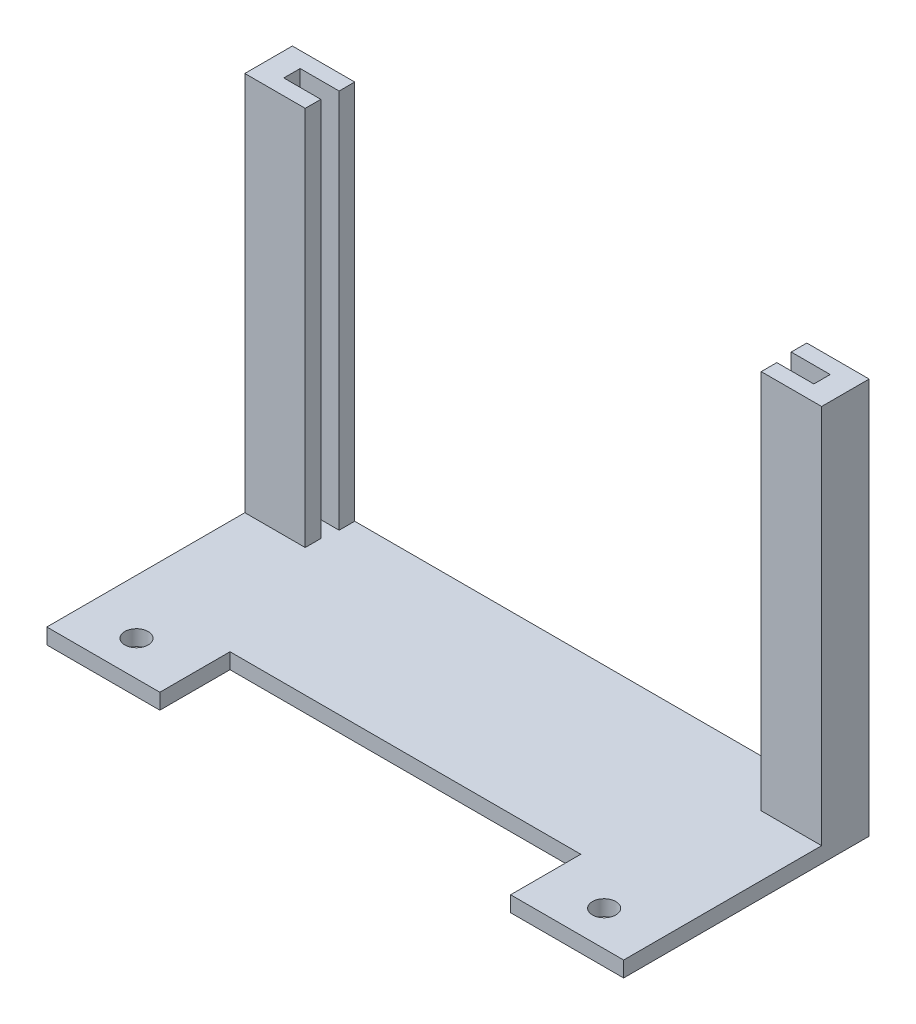
ISO-10303-21;
HEADER;
FILE_DESCRIPTION(('STEP AP214'),'2;1');
FILE_NAME('part.step','',(''),(''),'','','');
FILE_SCHEMA(('AUTOMOTIVE_DESIGN { 1 0 10303 214 1 1 1 1 }'));
ENDSEC;
DATA;
#1=APPLICATION_CONTEXT('core data for automotive mechanical design processes');
#2=APPLICATION_PROTOCOL_DEFINITION('international standard','automotive_design',2000,#1);
#3=PRODUCT_CONTEXT('',#1,'mechanical');
#4=PRODUCT('Part','Part','',(#3));
#5=PRODUCT_RELATED_PRODUCT_CATEGORY('part','',(#4));
#6=PRODUCT_DEFINITION_FORMATION('','',#4);
#7=PRODUCT_DEFINITION_CONTEXT('part definition',#1,'design');
#8=PRODUCT_DEFINITION('design','',#6,#7);
#9=PRODUCT_DEFINITION_SHAPE('','',#8);
#10=(LENGTH_UNIT() NAMED_UNIT(*) SI_UNIT(.MILLI.,.METRE.));
#11=(NAMED_UNIT(*) PLANE_ANGLE_UNIT() SI_UNIT($,.RADIAN.));
#12=(NAMED_UNIT(*) SI_UNIT($,.STERADIAN.) SOLID_ANGLE_UNIT());
#13=UNCERTAINTY_MEASURE_WITH_UNIT(LENGTH_MEASURE(1.E-05),#10,'distance_accuracy_value','');
#14=(GEOMETRIC_REPRESENTATION_CONTEXT(3) GLOBAL_UNCERTAINTY_ASSIGNED_CONTEXT((#13)) GLOBAL_UNIT_ASSIGNED_CONTEXT((#10,
#11,#12)) REPRESENTATION_CONTEXT('',''));
#15=CARTESIAN_POINT('',(0.,0.,0.));
#16=DIRECTION('',(0.,0.,1.));
#17=DIRECTION('',(1.,0.,0.));
#18=AXIS2_PLACEMENT_3D('',#15,#16,#17);
#19=CARTESIAN_POINT('',(0.,2.,0.));
#20=DIRECTION('',(0.,1.,0.));
#21=DIRECTION('',(0.,0.,1.));
#22=AXIS2_PLACEMENT_3D('',#19,#20,#21);
#23=PLANE('',#22);
#24=CARTESIAN_POINT('',(30.,2.,11.25));
#25=DIRECTION('',(0.,1.,0.));
#26=DIRECTION('',(0.,0.,1.));
#27=AXIS2_PLACEMENT_3D('',#24,#25,#26);
#28=CIRCLE('',#27,1.5);
#29=CARTESIAN_POINT('',(30.,2.,12.75));
#30=VERTEX_POINT('',#29);
#31=EDGE_CURVE('E353',#30,#30,#28,.T.);
#32=ORIENTED_EDGE('',*,*,#31,.F.);
#33=EDGE_LOOP('',(#32));
#34=FACE_BOUND('',#33,.T.);
#35=CARTESIAN_POINT('',(-30.,2.,11.25));
#36=DIRECTION('',(0.,1.,0.));
#37=DIRECTION('',(0.,0.,1.));
#38=AXIS2_PLACEMENT_3D('',#35,#36,#37);
#39=CIRCLE('',#38,1.5);
#40=CARTESIAN_POINT('',(-30.,2.,12.75));
#41=VERTEX_POINT('',#40);
#42=EDGE_CURVE('E357',#41,#41,#39,.T.);
#43=ORIENTED_EDGE('',*,*,#42,.F.);
#44=EDGE_LOOP('',(#43));
#45=FACE_BOUND('',#44,.T.);
#46=DIRECTION('',(0.,0.,1.));
#47=VECTOR('',#46,1.);
#48=CARTESIAN_POINT('',(37.,2.,0.));
#49=LINE('',#48,#47);
#50=CARTESIAN_POINT('',(37.,2.,-9.65000000000001));
#51=VERTEX_POINT('',#50);
#52=CARTESIAN_POINT('',(37.,2.,15.75));
#53=VERTEX_POINT('',#52);
#54=EDGE_CURVE('E328',#51,#53,#49,.T.);
#55=ORIENTED_EDGE('',*,*,#54,.F.);
#56=DIRECTION('',(-1.,0.,0.));
#57=VECTOR('',#56,1.);
#58=CARTESIAN_POINT('',(0.,2.,-9.65000000000001));
#59=LINE('',#58,#57);
#60=CARTESIAN_POINT('',(29.25,2.,-9.65000000000001));
#61=VERTEX_POINT('',#60);
#62=EDGE_CURVE('E242',#51,#61,#59,.T.);
#63=ORIENTED_EDGE('',*,*,#62,.T.);
#64=DIRECTION('',(0.,0.,-1.));
#65=VECTOR('',#64,1.);
#66=CARTESIAN_POINT('',(29.25,2.,0.));
#67=LINE('',#66,#65);
#68=CARTESIAN_POINT('',(29.25,2.,-11.65));
#69=VERTEX_POINT('',#68);
#70=EDGE_CURVE('E218',#61,#69,#67,.T.);
#71=ORIENTED_EDGE('',*,*,#70,.T.);
#72=DIRECTION('',(1.,0.,0.));
#73=VECTOR('',#72,1.);
#74=CARTESIAN_POINT('',(0.,2.,-11.65));
#75=LINE('',#74,#73);
#76=CARTESIAN_POINT('',(34.,2.,-11.65));
#77=VERTEX_POINT('',#76);
#78=EDGE_CURVE('E220',#69,#77,#75,.T.);
#79=ORIENTED_EDGE('',*,*,#78,.T.);
#80=DIRECTION('',(0.,0.,-1.));
#81=VECTOR('',#80,1.);
#82=CARTESIAN_POINT('',(34.,2.,0.));
#83=LINE('',#82,#81);
#84=CARTESIAN_POINT('',(34.,2.,-13.75));
#85=VERTEX_POINT('',#84);
#86=EDGE_CURVE('E225',#77,#85,#83,.T.);
#87=ORIENTED_EDGE('',*,*,#86,.T.);
#88=DIRECTION('',(-1.,0.,0.));
#89=VECTOR('',#88,1.);
#90=CARTESIAN_POINT('',(0.,2.,-13.75));
#91=LINE('',#90,#89);
#92=CARTESIAN_POINT('',(29.,2.,-13.75));
#93=VERTEX_POINT('',#92);
#94=EDGE_CURVE('E234',#85,#93,#91,.T.);
#95=ORIENTED_EDGE('',*,*,#94,.T.);
#96=DIRECTION('',(0.,0.,-1.));
#97=VECTOR('',#96,1.);
#98=CARTESIAN_POINT('',(29.,2.,0.));
#99=LINE('',#98,#97);
#100=CARTESIAN_POINT('',(29.,2.,-15.75));
#101=VERTEX_POINT('',#100);
#102=EDGE_CURVE('E238',#93,#101,#99,.T.);
#103=ORIENTED_EDGE('',*,*,#102,.T.);
#104=DIRECTION('',(1.,0.,0.));
#105=VECTOR('',#104,1.);
#106=CARTESIAN_POINT('',(0.,2.,-15.75));
#107=LINE('',#106,#105);
#108=CARTESIAN_POINT('',(-29.,2.,-15.75));
#109=VERTEX_POINT('',#108);
#110=EDGE_CURVE('E331',#109,#101,#107,.T.);
#111=ORIENTED_EDGE('',*,*,#110,.F.);
#112=DIRECTION('',(0.,0.,-1.));
#113=VECTOR('',#112,1.);
#114=CARTESIAN_POINT('',(-29.,2.,0.));
#115=LINE('',#114,#113);
#116=CARTESIAN_POINT('',(-29.,2.,-13.75));
#117=VERTEX_POINT('',#116);
#118=EDGE_CURVE('E306',#117,#109,#115,.T.);
#119=ORIENTED_EDGE('',*,*,#118,.F.);
#120=DIRECTION('',(1.,0.,0.));
#121=VECTOR('',#120,1.);
#122=CARTESIAN_POINT('',(0.,2.,-13.75));
#123=LINE('',#122,#121);
#124=CARTESIAN_POINT('',(-34.,2.,-13.75));
#125=VERTEX_POINT('',#124);
#126=EDGE_CURVE('E310',#125,#117,#123,.T.);
#127=ORIENTED_EDGE('',*,*,#126,.F.);
#128=DIRECTION('',(0.,0.,-1.));
#129=VECTOR('',#128,1.);
#130=CARTESIAN_POINT('',(-34.,2.,0.));
#131=LINE('',#130,#129);
#132=CARTESIAN_POINT('',(-34.,2.,-11.65));
#133=VERTEX_POINT('',#132);
#134=EDGE_CURVE('E314',#133,#125,#131,.T.);
#135=ORIENTED_EDGE('',*,*,#134,.F.);
#136=DIRECTION('',(-1.,0.,0.));
#137=VECTOR('',#136,1.);
#138=CARTESIAN_POINT('',(0.,2.,-11.65));
#139=LINE('',#138,#137);
#140=CARTESIAN_POINT('',(-29.25,2.,-11.65));
#141=VERTEX_POINT('',#140);
#142=EDGE_CURVE('E318',#141,#133,#139,.T.);
#143=ORIENTED_EDGE('',*,*,#142,.F.);
#144=DIRECTION('',(0.,0.,-1.));
#145=VECTOR('',#144,1.);
#146=CARTESIAN_POINT('',(-29.25,2.,0.));
#147=LINE('',#146,#145);
#148=CARTESIAN_POINT('',(-29.25,2.,-9.65000000000001));
#149=VERTEX_POINT('',#148);
#150=EDGE_CURVE('E65',#149,#141,#147,.T.);
#151=ORIENTED_EDGE('',*,*,#150,.F.);
#152=DIRECTION('',(1.,0.,0.));
#153=VECTOR('',#152,1.);
#154=CARTESIAN_POINT('',(0.,2.,-9.65000000000002));
#155=LINE('',#154,#153);
#156=CARTESIAN_POINT('',(-37.,2.,-9.65));
#157=VERTEX_POINT('',#156);
#158=EDGE_CURVE('E324',#157,#149,#155,.T.);
#159=ORIENTED_EDGE('',*,*,#158,.F.);
#160=DIRECTION('',(0.,0.,1.));
#161=VECTOR('',#160,1.);
#162=CARTESIAN_POINT('',(-37.,2.,0.));
#163=LINE('',#162,#161);
#164=CARTESIAN_POINT('',(-37.,2.,15.75));
#165=VERTEX_POINT('',#164);
#166=EDGE_CURVE('E336',#157,#165,#163,.T.);
#167=ORIENTED_EDGE('',*,*,#166,.T.);
#168=DIRECTION('',(1.,0.,0.));
#169=VECTOR('',#168,1.);
#170=CARTESIAN_POINT('',(0.,2.,15.75));
#171=LINE('',#170,#169);
#172=CARTESIAN_POINT('',(-22.5,2.,15.75));
#173=VERTEX_POINT('',#172);
#174=EDGE_CURVE('E339',#165,#173,#171,.T.);
#175=ORIENTED_EDGE('',*,*,#174,.T.);
#176=DIRECTION('',(0.,0.,1.));
#177=VECTOR('',#176,1.);
#178=CARTESIAN_POINT('',(-22.5,2.,0.));
#179=LINE('',#178,#177);
#180=CARTESIAN_POINT('',(-22.5,2.,6.74999999999999));
#181=VERTEX_POINT('',#180);
#182=EDGE_CURVE('E342',#181,#173,#179,.T.);
#183=ORIENTED_EDGE('',*,*,#182,.F.);
#184=DIRECTION('',(1.,0.,0.));
#185=VECTOR('',#184,1.);
#186=CARTESIAN_POINT('',(0.,2.,6.74999999999999));
#187=LINE('',#186,#185);
#188=CARTESIAN_POINT('',(22.5,2.,6.74999999999999));
#189=VERTEX_POINT('',#188);
#190=EDGE_CURVE('E347',#181,#189,#187,.T.);
#191=ORIENTED_EDGE('',*,*,#190,.T.);
#192=DIRECTION('',(0.,0.,1.));
#193=VECTOR('',#192,1.);
#194=CARTESIAN_POINT('',(22.5,2.,0.));
#195=LINE('',#194,#193);
#196=CARTESIAN_POINT('',(22.5,2.,15.75));
#197=VERTEX_POINT('',#196);
#198=EDGE_CURVE('E350',#189,#197,#195,.T.);
#199=ORIENTED_EDGE('',*,*,#198,.T.);
#200=EDGE_CURVE('E343',#197,#53,#171,.T.);
#201=ORIENTED_EDGE('',*,*,#200,.T.);
#202=EDGE_LOOP('',(#55,#63,#71,#79,#87,#95,#103,#111,#119,#127,#135,#143,#151,#159,#167,#175,
#183,#191,#199,#201));
#203=FACE_BOUND('',#202,.T.);
#204=ADVANCED_FACE('F41',(#34,#45,#203),#23,.T.);
#205=CARTESIAN_POINT('',(37.,2.,0.));
#206=DIRECTION('',(1.,0.,0.));
#207=DIRECTION('',(0.,0.,-1.));
#208=AXIS2_PLACEMENT_3D('',#205,#206,#207);
#209=PLANE('',#208);
#210=DIRECTION('',(0.,-1.,0.));
#211=VECTOR('',#210,1.);
#212=CARTESIAN_POINT('',(37.,50.8,-9.65000000000001));
#213=LINE('',#212,#211);
#214=CARTESIAN_POINT('',(37.,50.8,-9.65000000000001));
#215=VERTEX_POINT('',#214);
#216=EDGE_CURVE('E200',#215,#51,#213,.T.);
#217=ORIENTED_EDGE('',*,*,#216,.T.);
#218=ORIENTED_EDGE('',*,*,#54,.T.);
#219=DIRECTION('',(0.,-1.,0.));
#220=VECTOR('',#219,1.);
#221=CARTESIAN_POINT('',(37.,2.,15.75));
#222=LINE('',#221,#220);
#223=CARTESIAN_POINT('',(37.,0.,15.75));
#224=VERTEX_POINT('',#223);
#225=EDGE_CURVE('E361',#53,#224,#222,.T.);
#226=ORIENTED_EDGE('',*,*,#225,.T.);
#227=DIRECTION('',(0.,0.,1.));
#228=VECTOR('',#227,1.);
#229=CARTESIAN_POINT('',(37.,0.,0.));
#230=LINE('',#229,#228);
#231=CARTESIAN_POINT('',(37.,0.,-15.75));
#232=VERTEX_POINT('',#231);
#233=EDGE_CURVE('E327',#232,#224,#230,.T.);
#234=ORIENTED_EDGE('',*,*,#233,.F.);
#235=DIRECTION('',(0.,-1.,0.));
#236=VECTOR('',#235,1.);
#237=CARTESIAN_POINT('',(37.,2.,-15.75));
#238=LINE('',#237,#236);
#239=CARTESIAN_POINT('',(37.,50.8,-15.75));
#240=VERTEX_POINT('',#239);
#241=EDGE_CURVE('E11',#240,#232,#238,.T.);
#242=ORIENTED_EDGE('',*,*,#241,.F.);
#243=DIRECTION('',(0.,0.,1.));
#244=VECTOR('',#243,1.);
#245=CARTESIAN_POINT('',(37.,50.8,0.));
#246=LINE('',#245,#244);
#247=EDGE_CURVE('E205',#240,#215,#246,.T.);
#248=ORIENTED_EDGE('',*,*,#247,.T.);
#249=EDGE_LOOP('',(#217,#218,#226,#234,#242,#248));
#250=FACE_BOUND('',#249,.T.);
#251=ADVANCED_FACE('F43',(#250),#209,.T.);
#252=CARTESIAN_POINT('',(0.,2.,-15.75));
#253=DIRECTION('',(0.,0.,-1.));
#254=DIRECTION('',(-1.,0.,0.));
#255=AXIS2_PLACEMENT_3D('',#252,#253,#254);
#256=PLANE('',#255);
#257=ORIENTED_EDGE('',*,*,#241,.T.);
#258=DIRECTION('',(1.,0.,0.));
#259=VECTOR('',#258,1.);
#260=CARTESIAN_POINT('',(0.,0.,-15.75));
#261=LINE('',#260,#259);
#262=CARTESIAN_POINT('',(-37.,0.,-15.75));
#263=VERTEX_POINT('',#262);
#264=EDGE_CURVE('E364',#263,#232,#261,.T.);
#265=ORIENTED_EDGE('',*,*,#264,.F.);
#266=DIRECTION('',(0.,-1.,0.));
#267=VECTOR('',#266,1.);
#268=CARTESIAN_POINT('',(-37.,2.,-15.75));
#269=LINE('',#268,#267);
#270=CARTESIAN_POINT('',(-37.,50.8,-15.75));
#271=VERTEX_POINT('',#270);
#272=EDGE_CURVE('E50',#271,#263,#269,.T.);
#273=ORIENTED_EDGE('',*,*,#272,.F.);
#274=DIRECTION('',(1.,0.,0.));
#275=VECTOR('',#274,1.);
#276=CARTESIAN_POINT('',(0.,50.8,-15.75));
#277=LINE('',#276,#275);
#278=CARTESIAN_POINT('',(-29.,50.8,-15.75));
#279=VERTEX_POINT('',#278);
#280=EDGE_CURVE('E271',#271,#279,#277,.T.);
#281=ORIENTED_EDGE('',*,*,#280,.T.);
#282=DIRECTION('',(0.,-1.,0.));
#283=VECTOR('',#282,1.);
#284=CARTESIAN_POINT('',(-29.,50.8,-15.75));
#285=LINE('',#284,#283);
#286=EDGE_CURVE('E282',#279,#109,#285,.T.);
#287=ORIENTED_EDGE('',*,*,#286,.T.);
#288=ORIENTED_EDGE('',*,*,#110,.T.);
#289=DIRECTION('',(0.,-1.,0.));
#290=VECTOR('',#289,1.);
#291=CARTESIAN_POINT('',(29.,50.8,-15.75));
#292=LINE('',#291,#290);
#293=CARTESIAN_POINT('',(29.,50.8,-15.75));
#294=VERTEX_POINT('',#293);
#295=EDGE_CURVE('E227',#294,#101,#292,.T.);
#296=ORIENTED_EDGE('',*,*,#295,.F.);
#297=DIRECTION('',(1.,0.,0.));
#298=VECTOR('',#297,1.);
#299=CARTESIAN_POINT('',(0.,50.8,-15.75));
#300=LINE('',#299,#298);
#301=EDGE_CURVE('E430',#294,#240,#300,.T.);
#302=ORIENTED_EDGE('',*,*,#301,.T.);
#303=EDGE_LOOP('',(#257,#265,#273,#281,#287,#288,#296,#302));
#304=FACE_BOUND('',#303,.T.);
#305=ADVANCED_FACE('F426',(#304),#256,.T.);
#306=CARTESIAN_POINT('',(-37.,2.,0.));
#307=DIRECTION('',(1.,0.,0.));
#308=DIRECTION('',(0.,0.,-1.));
#309=AXIS2_PLACEMENT_3D('',#306,#307,#308);
#310=PLANE('',#309);
#311=ORIENTED_EDGE('',*,*,#166,.F.);
#312=DIRECTION('',(0.,-1.,0.));
#313=VECTOR('',#312,1.);
#314=CARTESIAN_POINT('',(-37.,50.8,-9.65));
#315=LINE('',#314,#313);
#316=CARTESIAN_POINT('',(-37.,50.8,-9.65));
#317=VERTEX_POINT('',#316);
#318=EDGE_CURVE('E278',#317,#157,#315,.T.);
#319=ORIENTED_EDGE('',*,*,#318,.F.);
#320=DIRECTION('',(0.,0.,1.));
#321=VECTOR('',#320,1.);
#322=CARTESIAN_POINT('',(-37.,50.8,0.));
#323=LINE('',#322,#321);
#324=EDGE_CURVE('E275',#271,#317,#323,.T.);
#325=ORIENTED_EDGE('',*,*,#324,.F.);
#326=ORIENTED_EDGE('',*,*,#272,.T.);
#327=DIRECTION('',(0.,0.,1.));
#328=VECTOR('',#327,1.);
#329=CARTESIAN_POINT('',(-37.,0.,0.));
#330=LINE('',#329,#328);
#331=CARTESIAN_POINT('',(-37.,0.,15.75));
#332=VERTEX_POINT('',#331);
#333=EDGE_CURVE('E367',#263,#332,#330,.T.);
#334=ORIENTED_EDGE('',*,*,#333,.T.);
#335=DIRECTION('',(0.,-1.,0.));
#336=VECTOR('',#335,1.);
#337=CARTESIAN_POINT('',(-37.,2.,15.75));
#338=LINE('',#337,#336);
#339=EDGE_CURVE('E409',#165,#332,#338,.T.);
#340=ORIENTED_EDGE('',*,*,#339,.F.);
#341=EDGE_LOOP('',(#311,#319,#325,#326,#334,#340));
#342=FACE_BOUND('',#341,.T.);
#343=ADVANCED_FACE('F416',(#342),#310,.F.);
#344=CARTESIAN_POINT('',(0.,2.,15.75));
#345=DIRECTION('',(0.,0.,-1.));
#346=DIRECTION('',(-1.,0.,0.));
#347=AXIS2_PLACEMENT_3D('',#344,#345,#346);
#348=PLANE('',#347);
#349=DIRECTION('',(1.,0.,0.));
#350=VECTOR('',#349,1.);
#351=CARTESIAN_POINT('',(0.,0.,15.75));
#352=LINE('',#351,#350);
#353=CARTESIAN_POINT('',(-22.5,0.,15.75));
#354=VERTEX_POINT('',#353);
#355=EDGE_CURVE('E370',#332,#354,#352,.T.);
#356=ORIENTED_EDGE('',*,*,#355,.T.);
#357=DIRECTION('',(0.,-1.,0.));
#358=VECTOR('',#357,1.);
#359=CARTESIAN_POINT('',(-22.5,2.,15.75));
#360=LINE('',#359,#358);
#361=EDGE_CURVE('E406',#173,#354,#360,.T.);
#362=ORIENTED_EDGE('',*,*,#361,.F.);
#363=ORIENTED_EDGE('',*,*,#174,.F.);
#364=ORIENTED_EDGE('',*,*,#339,.T.);
#365=EDGE_LOOP('',(#356,#362,#363,#364));
#366=FACE_BOUND('',#365,.T.);
#367=ADVANCED_FACE('F450',(#366),#348,.F.);
#368=CARTESIAN_POINT('',(-22.5,2.,0.));
#369=DIRECTION('',(1.,0.,0.));
#370=DIRECTION('',(0.,0.,-1.));
#371=AXIS2_PLACEMENT_3D('',#368,#369,#370);
#372=PLANE('',#371);
#373=DIRECTION('',(0.,0.,1.));
#374=VECTOR('',#373,1.);
#375=CARTESIAN_POINT('',(-22.5,0.,0.));
#376=LINE('',#375,#374);
#377=CARTESIAN_POINT('',(-22.5,0.,6.74999999999999));
#378=VERTEX_POINT('',#377);
#379=EDGE_CURVE('E374',#378,#354,#376,.T.);
#380=ORIENTED_EDGE('',*,*,#379,.F.);
#381=DIRECTION('',(0.,-1.,0.));
#382=VECTOR('',#381,1.);
#383=CARTESIAN_POINT('',(-22.5,2.,6.74999999999999));
#384=LINE('',#383,#382);
#385=EDGE_CURVE('E403',#181,#378,#384,.T.);
#386=ORIENTED_EDGE('',*,*,#385,.F.);
#387=ORIENTED_EDGE('',*,*,#182,.T.);
#388=ORIENTED_EDGE('',*,*,#361,.T.);
#389=EDGE_LOOP('',(#380,#386,#387,#388));
#390=FACE_BOUND('',#389,.T.);
#391=ADVANCED_FACE('F462',(#390),#372,.T.);
#392=CARTESIAN_POINT('',(0.,2.,6.74999999999999));
#393=DIRECTION('',(0.,0.,-1.));
#394=DIRECTION('',(-1.,0.,0.));
#395=AXIS2_PLACEMENT_3D('',#392,#393,#394);
#396=PLANE('',#395);
#397=DIRECTION('',(1.,0.,0.));
#398=VECTOR('',#397,1.);
#399=CARTESIAN_POINT('',(0.,0.,6.74999999999999));
#400=LINE('',#399,#398);
#401=CARTESIAN_POINT('',(22.5,0.,6.74999999999999));
#402=VERTEX_POINT('',#401);
#403=EDGE_CURVE('E379',#378,#402,#400,.T.);
#404=ORIENTED_EDGE('',*,*,#403,.T.);
#405=DIRECTION('',(0.,-1.,0.));
#406=VECTOR('',#405,1.);
#407=CARTESIAN_POINT('',(22.5,2.,6.74999999999999));
#408=LINE('',#407,#406);
#409=EDGE_CURVE('E399',#189,#402,#408,.T.);
#410=ORIENTED_EDGE('',*,*,#409,.F.);
#411=ORIENTED_EDGE('',*,*,#190,.F.);
#412=ORIENTED_EDGE('',*,*,#385,.T.);
#413=EDGE_LOOP('',(#404,#410,#411,#412));
#414=FACE_BOUND('',#413,.T.);
#415=ADVANCED_FACE('F496',(#414),#396,.F.);
#416=CARTESIAN_POINT('',(22.5,2.,0.));
#417=DIRECTION('',(1.,0.,0.));
#418=DIRECTION('',(0.,0.,-1.));
#419=AXIS2_PLACEMENT_3D('',#416,#417,#418);
#420=PLANE('',#419);
#421=DIRECTION('',(0.,0.,1.));
#422=VECTOR('',#421,1.);
#423=CARTESIAN_POINT('',(22.5,0.,0.));
#424=LINE('',#423,#422);
#425=CARTESIAN_POINT('',(22.5,0.,15.75));
#426=VERTEX_POINT('',#425);
#427=EDGE_CURVE('E382',#402,#426,#424,.T.);
#428=ORIENTED_EDGE('',*,*,#427,.T.);
#429=DIRECTION('',(0.,-1.,0.));
#430=VECTOR('',#429,1.);
#431=CARTESIAN_POINT('',(22.5,2.,15.75));
#432=LINE('',#431,#430);
#433=EDGE_CURVE('E395',#197,#426,#432,.T.);
#434=ORIENTED_EDGE('',*,*,#433,.F.);
#435=ORIENTED_EDGE('',*,*,#198,.F.);
#436=ORIENTED_EDGE('',*,*,#409,.T.);
#437=EDGE_LOOP('',(#428,#434,#435,#436));
#438=FACE_BOUND('',#437,.T.);
#439=ADVANCED_FACE('F457',(#438),#420,.F.);
#440=CARTESIAN_POINT('',(30.,2.,11.25));
#441=DIRECTION('',(0.,-1.,0.));
#442=DIRECTION('',(0.,0.,-1.));
#443=AXIS2_PLACEMENT_3D('',#440,#441,#442);
#444=CYLINDRICAL_SURFACE('',#443,1.5);
#445=ORIENTED_EDGE('',*,*,#31,.T.);
#446=EDGE_LOOP('',(#445));
#447=FACE_BOUND('',#446,.T.);
#448=CARTESIAN_POINT('',(30.,0.,11.25));
#449=DIRECTION('',(0.,1.,0.));
#450=DIRECTION('',(0.,0.,1.));
#451=AXIS2_PLACEMENT_3D('',#448,#449,#450);
#452=CIRCLE('',#451,1.5);
#453=CARTESIAN_POINT('',(30.,0.,12.75));
#454=VERTEX_POINT('',#453);
#455=EDGE_CURVE('E385',#454,#454,#452,.T.);
#456=ORIENTED_EDGE('',*,*,#455,.F.);
#457=EDGE_LOOP('',(#456));
#458=FACE_BOUND('',#457,.T.);
#459=ADVANCED_FACE('F448',(#447,#458),#444,.F.);
#460=EDGE_CURVE('E375',#426,#224,#352,.T.);
#461=ORIENTED_EDGE('',*,*,#460,.T.);
#462=ORIENTED_EDGE('',*,*,#225,.F.);
#463=ORIENTED_EDGE('',*,*,#200,.F.);
#464=ORIENTED_EDGE('',*,*,#433,.T.);
#465=EDGE_LOOP('',(#461,#462,#463,#464));
#466=FACE_BOUND('',#465,.T.);
#467=ADVANCED_FACE('F445',(#466),#348,.F.);
#468=CARTESIAN_POINT('',(-30.,2.,11.25));
#469=DIRECTION('',(0.,-1.,0.));
#470=DIRECTION('',(0.,0.,-1.));
#471=AXIS2_PLACEMENT_3D('',#468,#469,#470);
#472=CYLINDRICAL_SURFACE('',#471,1.5);
#473=ORIENTED_EDGE('',*,*,#42,.T.);
#474=EDGE_LOOP('',(#473));
#475=FACE_BOUND('',#474,.T.);
#476=CARTESIAN_POINT('',(-30.,0.,11.25));
#477=DIRECTION('',(0.,1.,0.));
#478=DIRECTION('',(0.,0.,1.));
#479=AXIS2_PLACEMENT_3D('',#476,#477,#478);
#480=CIRCLE('',#479,1.5);
#481=CARTESIAN_POINT('',(-30.,0.,12.75));
#482=VERTEX_POINT('',#481);
#483=EDGE_CURVE('E332',#482,#482,#480,.T.);
#484=ORIENTED_EDGE('',*,*,#483,.F.);
#485=EDGE_LOOP('',(#484));
#486=FACE_BOUND('',#485,.T.);
#487=ADVANCED_FACE('F447',(#475,#486),#472,.F.);
#488=CARTESIAN_POINT('',(0.,0.,0.));
#489=DIRECTION('',(0.,1.,0.));
#490=DIRECTION('',(0.,0.,1.));
#491=AXIS2_PLACEMENT_3D('',#488,#489,#490);
#492=PLANE('',#491);
#493=ORIENTED_EDGE('',*,*,#264,.T.);
#494=ORIENTED_EDGE('',*,*,#233,.T.);
#495=ORIENTED_EDGE('',*,*,#460,.F.);
#496=ORIENTED_EDGE('',*,*,#427,.F.);
#497=ORIENTED_EDGE('',*,*,#403,.F.);
#498=ORIENTED_EDGE('',*,*,#379,.T.);
#499=ORIENTED_EDGE('',*,*,#355,.F.);
#500=ORIENTED_EDGE('',*,*,#333,.F.);
#501=EDGE_LOOP('',(#493,#494,#495,#496,#497,#498,#499,#500));
#502=FACE_BOUND('',#501,.T.);
#503=ORIENTED_EDGE('',*,*,#483,.T.);
#504=EDGE_LOOP('',(#503));
#505=FACE_BOUND('',#504,.T.);
#506=ORIENTED_EDGE('',*,*,#455,.T.);
#507=EDGE_LOOP('',(#506));
#508=FACE_BOUND('',#507,.T.);
#509=ADVANCED_FACE('F424',(#502,#505,#508),#492,.F.);
#510=CARTESIAN_POINT('',(0.,50.8,-9.65000000000002));
#511=DIRECTION('',(0.,0.,1.));
#512=DIRECTION('',(1.,0.,0.));
#513=AXIS2_PLACEMENT_3D('',#510,#511,#512);
#514=PLANE('',#513);
#515=ORIENTED_EDGE('',*,*,#318,.T.);
#516=ORIENTED_EDGE('',*,*,#158,.T.);
#517=DIRECTION('',(0.,-1.,0.));
#518=VECTOR('',#517,1.);
#519=CARTESIAN_POINT('',(-29.25,50.8,-9.65000000000001));
#520=LINE('',#519,#518);
#521=CARTESIAN_POINT('',(-29.25,50.8,-9.65000000000001));
#522=VERTEX_POINT('',#521);
#523=EDGE_CURVE('E302',#522,#149,#520,.T.);
#524=ORIENTED_EDGE('',*,*,#523,.F.);
#525=DIRECTION('',(-1.,0.,0.));
#526=VECTOR('',#525,1.);
#527=CARTESIAN_POINT('',(0.,50.8,-9.65000000000002));
#528=LINE('',#527,#526);
#529=EDGE_CURVE('E247',#522,#317,#528,.T.);
#530=ORIENTED_EDGE('',*,*,#529,.T.);
#531=EDGE_LOOP('',(#515,#516,#524,#530));
#532=FACE_BOUND('',#531,.T.);
#533=ADVANCED_FACE('F474',(#532),#514,.T.);
#534=CARTESIAN_POINT('',(-29.25,50.8,0.));
#535=DIRECTION('',(1.,0.,0.));
#536=DIRECTION('',(0.,0.,-1.));
#537=AXIS2_PLACEMENT_3D('',#534,#535,#536);
#538=PLANE('',#537);
#539=ORIENTED_EDGE('',*,*,#523,.T.);
#540=ORIENTED_EDGE('',*,*,#150,.T.);
#541=DIRECTION('',(0.,-1.,0.));
#542=VECTOR('',#541,1.);
#543=CARTESIAN_POINT('',(-29.25,50.8,-11.65));
#544=LINE('',#543,#542);
#545=CARTESIAN_POINT('',(-29.25,50.8,-11.65));
#546=VERTEX_POINT('',#545);
#547=EDGE_CURVE('E298',#546,#141,#544,.T.);
#548=ORIENTED_EDGE('',*,*,#547,.F.);
#549=DIRECTION('',(0.,0.,1.));
#550=VECTOR('',#549,1.);
#551=CARTESIAN_POINT('',(-29.25,50.8,0.));
#552=LINE('',#551,#550);
#553=EDGE_CURVE('E251',#546,#522,#552,.T.);
#554=ORIENTED_EDGE('',*,*,#553,.T.);
#555=EDGE_LOOP('',(#539,#540,#548,#554));
#556=FACE_BOUND('',#555,.T.);
#557=ADVANCED_FACE('F480',(#556),#538,.T.);
#558=CARTESIAN_POINT('',(0.,50.8,-11.65));
#559=DIRECTION('',(0.,0.,-1.));
#560=DIRECTION('',(-1.,0.,0.));
#561=AXIS2_PLACEMENT_3D('',#558,#559,#560);
#562=PLANE('',#561);
#563=ORIENTED_EDGE('',*,*,#547,.T.);
#564=ORIENTED_EDGE('',*,*,#142,.T.);
#565=DIRECTION('',(0.,-1.,0.));
#566=VECTOR('',#565,1.);
#567=CARTESIAN_POINT('',(-34.,50.8,-11.65));
#568=LINE('',#567,#566);
#569=CARTESIAN_POINT('',(-34.,50.8,-11.65));
#570=VERTEX_POINT('',#569);
#571=EDGE_CURVE('E294',#570,#133,#568,.T.);
#572=ORIENTED_EDGE('',*,*,#571,.F.);
#573=DIRECTION('',(1.,0.,0.));
#574=VECTOR('',#573,1.);
#575=CARTESIAN_POINT('',(0.,50.8,-11.65));
#576=LINE('',#575,#574);
#577=EDGE_CURVE('E255',#570,#546,#576,.T.);
#578=ORIENTED_EDGE('',*,*,#577,.T.);
#579=EDGE_LOOP('',(#563,#564,#572,#578));
#580=FACE_BOUND('',#579,.T.);
#581=ADVANCED_FACE('F485',(#580),#562,.T.);
#582=CARTESIAN_POINT('',(-34.,50.8,0.));
#583=DIRECTION('',(1.,0.,0.));
#584=DIRECTION('',(0.,0.,-1.));
#585=AXIS2_PLACEMENT_3D('',#582,#583,#584);
#586=PLANE('',#585);
#587=ORIENTED_EDGE('',*,*,#571,.T.);
#588=ORIENTED_EDGE('',*,*,#134,.T.);
#589=DIRECTION('',(0.,-1.,0.));
#590=VECTOR('',#589,1.);
#591=CARTESIAN_POINT('',(-34.,50.8,-13.75));
#592=LINE('',#591,#590);
#593=CARTESIAN_POINT('',(-34.,50.8,-13.75));
#594=VERTEX_POINT('',#593);
#595=EDGE_CURVE('E290',#594,#125,#592,.T.);
#596=ORIENTED_EDGE('',*,*,#595,.F.);
#597=DIRECTION('',(0.,0.,1.));
#598=VECTOR('',#597,1.);
#599=CARTESIAN_POINT('',(-34.,50.8,0.));
#600=LINE('',#599,#598);
#601=EDGE_CURVE('E259',#594,#570,#600,.T.);
#602=ORIENTED_EDGE('',*,*,#601,.T.);
#603=EDGE_LOOP('',(#587,#588,#596,#602));
#604=FACE_BOUND('',#603,.T.);
#605=ADVANCED_FACE('F593',(#604),#586,.T.);
#606=CARTESIAN_POINT('',(0.,50.8,-13.75));
#607=DIRECTION('',(0.,0.,1.));
#608=DIRECTION('',(1.,0.,0.));
#609=AXIS2_PLACEMENT_3D('',#606,#607,#608);
#610=PLANE('',#609);
#611=ORIENTED_EDGE('',*,*,#595,.T.);
#612=ORIENTED_EDGE('',*,*,#126,.T.);
#613=DIRECTION('',(0.,-1.,0.));
#614=VECTOR('',#613,1.);
#615=CARTESIAN_POINT('',(-29.,50.8,-13.75));
#616=LINE('',#615,#614);
#617=CARTESIAN_POINT('',(-29.,50.8,-13.75));
#618=VERTEX_POINT('',#617);
#619=EDGE_CURVE('E286',#618,#117,#616,.T.);
#620=ORIENTED_EDGE('',*,*,#619,.F.);
#621=DIRECTION('',(-1.,0.,0.));
#622=VECTOR('',#621,1.);
#623=CARTESIAN_POINT('',(0.,50.8,-13.75));
#624=LINE('',#623,#622);
#625=EDGE_CURVE('E263',#618,#594,#624,.T.);
#626=ORIENTED_EDGE('',*,*,#625,.T.);
#627=EDGE_LOOP('',(#611,#612,#620,#626));
#628=FACE_BOUND('',#627,.T.);
#629=ADVANCED_FACE('F602',(#628),#610,.T.);
#630=CARTESIAN_POINT('',(-29.,50.8,0.));
#631=DIRECTION('',(1.,0.,0.));
#632=DIRECTION('',(0.,0.,-1.));
#633=AXIS2_PLACEMENT_3D('',#630,#631,#632);
#634=PLANE('',#633);
#635=ORIENTED_EDGE('',*,*,#619,.T.);
#636=ORIENTED_EDGE('',*,*,#118,.T.);
#637=ORIENTED_EDGE('',*,*,#286,.F.);
#638=DIRECTION('',(0.,0.,1.));
#639=VECTOR('',#638,1.);
#640=CARTESIAN_POINT('',(-29.,50.8,0.));
#641=LINE('',#640,#639);
#642=EDGE_CURVE('E267',#279,#618,#641,.T.);
#643=ORIENTED_EDGE('',*,*,#642,.T.);
#644=EDGE_LOOP('',(#635,#636,#637,#643));
#645=FACE_BOUND('',#644,.T.);
#646=ADVANCED_FACE('F611',(#645),#634,.T.);
#647=CARTESIAN_POINT('',(0.,50.8,0.));
#648=DIRECTION('',(0.,1.,0.));
#649=DIRECTION('',(0.,0.,1.));
#650=AXIS2_PLACEMENT_3D('',#647,#648,#649);
#651=PLANE('',#650);
#652=ORIENTED_EDGE('',*,*,#529,.F.);
#653=ORIENTED_EDGE('',*,*,#553,.F.);
#654=ORIENTED_EDGE('',*,*,#577,.F.);
#655=ORIENTED_EDGE('',*,*,#601,.F.);
#656=ORIENTED_EDGE('',*,*,#625,.F.);
#657=ORIENTED_EDGE('',*,*,#642,.F.);
#658=ORIENTED_EDGE('',*,*,#280,.F.);
#659=ORIENTED_EDGE('',*,*,#324,.T.);
#660=EDGE_LOOP('',(#652,#653,#654,#655,#656,#657,#658,#659));
#661=FACE_BOUND('',#660,.T.);
#662=ADVANCED_FACE('F620',(#661),#651,.T.);
#663=CARTESIAN_POINT('',(29.25,50.8,0.));
#664=DIRECTION('',(1.,0.,0.));
#665=DIRECTION('',(0.,0.,-1.));
#666=AXIS2_PLACEMENT_3D('',#663,#664,#665);
#667=PLANE('',#666);
#668=ORIENTED_EDGE('',*,*,#70,.F.);
#669=DIRECTION('',(0.,-1.,0.));
#670=VECTOR('',#669,1.);
#671=CARTESIAN_POINT('',(29.25,50.8,-9.65000000000001));
#672=LINE('',#671,#670);
#673=CARTESIAN_POINT('',(29.25,50.8,-9.65000000000001));
#674=VERTEX_POINT('',#673);
#675=EDGE_CURVE('E197',#674,#61,#672,.T.);
#676=ORIENTED_EDGE('',*,*,#675,.F.);
#677=DIRECTION('',(0.,0.,1.));
#678=VECTOR('',#677,1.);
#679=CARTESIAN_POINT('',(29.25,50.8,0.));
#680=LINE('',#679,#678);
#681=CARTESIAN_POINT('',(29.25,50.8,-11.65));
#682=VERTEX_POINT('',#681);
#683=EDGE_CURVE('E206',#682,#674,#680,.T.);
#684=ORIENTED_EDGE('',*,*,#683,.F.);
#685=DIRECTION('',(0.,-1.,0.));
#686=VECTOR('',#685,1.);
#687=CARTESIAN_POINT('',(29.25,50.8,-11.65));
#688=LINE('',#687,#686);
#689=EDGE_CURVE('E700',#682,#69,#688,.T.);
#690=ORIENTED_EDGE('',*,*,#689,.T.);
#691=EDGE_LOOP('',(#668,#676,#684,#690));
#692=FACE_BOUND('',#691,.T.);
#693=ADVANCED_FACE('F216',(#692),#667,.F.);
#694=CARTESIAN_POINT('',(0.,50.8,-9.65000000000001));
#695=DIRECTION('',(0.,0.,-1.));
#696=DIRECTION('',(-1.,0.,0.));
#697=AXIS2_PLACEMENT_3D('',#694,#695,#696);
#698=PLANE('',#697);
#699=ORIENTED_EDGE('',*,*,#62,.F.);
#700=ORIENTED_EDGE('',*,*,#216,.F.);
#701=DIRECTION('',(1.,0.,0.));
#702=VECTOR('',#701,1.);
#703=CARTESIAN_POINT('',(0.,50.8,-9.65000000000001));
#704=LINE('',#703,#702);
#705=EDGE_CURVE('E193',#674,#215,#704,.T.);
#706=ORIENTED_EDGE('',*,*,#705,.F.);
#707=ORIENTED_EDGE('',*,*,#675,.T.);
#708=EDGE_LOOP('',(#699,#700,#706,#707));
#709=FACE_BOUND('',#708,.T.);
#710=ADVANCED_FACE('F195',(#709),#698,.F.);
#711=CARTESIAN_POINT('',(29.,50.8,0.));
#712=DIRECTION('',(1.,0.,0.));
#713=DIRECTION('',(0.,0.,-1.));
#714=AXIS2_PLACEMENT_3D('',#711,#712,#713);
#715=PLANE('',#714);
#716=ORIENTED_EDGE('',*,*,#102,.F.);
#717=DIRECTION('',(0.,-1.,0.));
#718=VECTOR('',#717,1.);
#719=CARTESIAN_POINT('',(29.,50.8,-13.75));
#720=LINE('',#719,#718);
#721=CARTESIAN_POINT('',(29.,50.8,-13.75));
#722=VERTEX_POINT('',#721);
#723=EDGE_CURVE('E725',#722,#93,#720,.T.);
#724=ORIENTED_EDGE('',*,*,#723,.F.);
#725=DIRECTION('',(0.,0.,1.));
#726=VECTOR('',#725,1.);
#727=CARTESIAN_POINT('',(29.,50.8,0.));
#728=LINE('',#727,#726);
#729=EDGE_CURVE('E706',#294,#722,#728,.T.);
#730=ORIENTED_EDGE('',*,*,#729,.F.);
#731=ORIENTED_EDGE('',*,*,#295,.T.);
#732=EDGE_LOOP('',(#716,#724,#730,#731));
#733=FACE_BOUND('',#732,.T.);
#734=ADVANCED_FACE('F644',(#733),#715,.F.);
#735=CARTESIAN_POINT('',(0.,50.8,-13.75));
#736=DIRECTION('',(0.,0.,-1.));
#737=DIRECTION('',(-1.,0.,0.));
#738=AXIS2_PLACEMENT_3D('',#735,#736,#737);
#739=PLANE('',#738);
#740=ORIENTED_EDGE('',*,*,#94,.F.);
#741=DIRECTION('',(0.,-1.,0.));
#742=VECTOR('',#741,1.);
#743=CARTESIAN_POINT('',(34.,50.8,-13.75));
#744=LINE('',#743,#742);
#745=CARTESIAN_POINT('',(34.,50.8,-13.75));
#746=VERTEX_POINT('',#745);
#747=EDGE_CURVE('E721',#746,#85,#744,.T.);
#748=ORIENTED_EDGE('',*,*,#747,.F.);
#749=DIRECTION('',(1.,0.,0.));
#750=VECTOR('',#749,1.);
#751=CARTESIAN_POINT('',(0.,50.8,-13.75));
#752=LINE('',#751,#750);
#753=EDGE_CURVE('E711',#722,#746,#752,.T.);
#754=ORIENTED_EDGE('',*,*,#753,.F.);
#755=ORIENTED_EDGE('',*,*,#723,.T.);
#756=EDGE_LOOP('',(#740,#748,#754,#755));
#757=FACE_BOUND('',#756,.T.);
#758=ADVANCED_FACE('F652',(#757),#739,.F.);
#759=CARTESIAN_POINT('',(34.,50.8,0.));
#760=DIRECTION('',(1.,0.,0.));
#761=DIRECTION('',(0.,0.,-1.));
#762=AXIS2_PLACEMENT_3D('',#759,#760,#761);
#763=PLANE('',#762);
#764=ORIENTED_EDGE('',*,*,#86,.F.);
#765=DIRECTION('',(0.,-1.,0.));
#766=VECTOR('',#765,1.);
#767=CARTESIAN_POINT('',(34.,50.8,-11.65));
#768=LINE('',#767,#766);
#769=CARTESIAN_POINT('',(34.,50.8,-11.65));
#770=VERTEX_POINT('',#769);
#771=EDGE_CURVE('E57',#770,#77,#768,.T.);
#772=ORIENTED_EDGE('',*,*,#771,.F.);
#773=DIRECTION('',(0.,0.,1.));
#774=VECTOR('',#773,1.);
#775=CARTESIAN_POINT('',(34.,50.8,0.));
#776=LINE('',#775,#774);
#777=EDGE_CURVE('E714',#746,#770,#776,.T.);
#778=ORIENTED_EDGE('',*,*,#777,.F.);
#779=ORIENTED_EDGE('',*,*,#747,.T.);
#780=EDGE_LOOP('',(#764,#772,#778,#779));
#781=FACE_BOUND('',#780,.T.);
#782=ADVANCED_FACE('F661',(#781),#763,.F.);
#783=CARTESIAN_POINT('',(0.,50.8,-11.65));
#784=DIRECTION('',(0.,0.,1.));
#785=DIRECTION('',(1.,0.,0.));
#786=AXIS2_PLACEMENT_3D('',#783,#784,#785);
#787=PLANE('',#786);
#788=ORIENTED_EDGE('',*,*,#78,.F.);
#789=ORIENTED_EDGE('',*,*,#689,.F.);
#790=DIRECTION('',(-1.,0.,0.));
#791=VECTOR('',#790,1.);
#792=CARTESIAN_POINT('',(0.,50.8,-11.65));
#793=LINE('',#792,#791);
#794=EDGE_CURVE('E210',#770,#682,#793,.T.);
#795=ORIENTED_EDGE('',*,*,#794,.F.);
#796=ORIENTED_EDGE('',*,*,#771,.T.);
#797=EDGE_LOOP('',(#788,#789,#795,#796));
#798=FACE_BOUND('',#797,.T.);
#799=ADVANCED_FACE('F670',(#798),#787,.F.);
#800=CARTESIAN_POINT('',(0.,50.8,0.));
#801=DIRECTION('',(0.,1.,0.));
#802=DIRECTION('',(0.,0.,1.));
#803=AXIS2_PLACEMENT_3D('',#800,#801,#802);
#804=PLANE('',#803);
#805=ORIENTED_EDGE('',*,*,#683,.T.);
#806=ORIENTED_EDGE('',*,*,#705,.T.);
#807=ORIENTED_EDGE('',*,*,#247,.F.);
#808=ORIENTED_EDGE('',*,*,#301,.F.);
#809=ORIENTED_EDGE('',*,*,#729,.T.);
#810=ORIENTED_EDGE('',*,*,#753,.T.);
#811=ORIENTED_EDGE('',*,*,#777,.T.);
#812=ORIENTED_EDGE('',*,*,#794,.T.);
#813=EDGE_LOOP('',(#805,#806,#807,#808,#809,#810,#811,#812));
#814=FACE_BOUND('',#813,.T.);
#815=ADVANCED_FACE('F209',(#814),#804,.T.);
#816=CLOSED_SHELL('',(#204,#251,#305,#343,#367,#391,#415,#439,#459,#467,#487,#509,#533,#557,
#581,#605,#629,#646,#662,#693,#710,#734,#758,#782,#799,#815));
#817=MANIFOLD_SOLID_BREP('B2',#816);
#818=ADVANCED_BREP_SHAPE_REPRESENTATION('',(#18,#817),#14);
#819=SHAPE_DEFINITION_REPRESENTATION(#9,#818);
ENDSEC;
END-ISO-10303-21;
